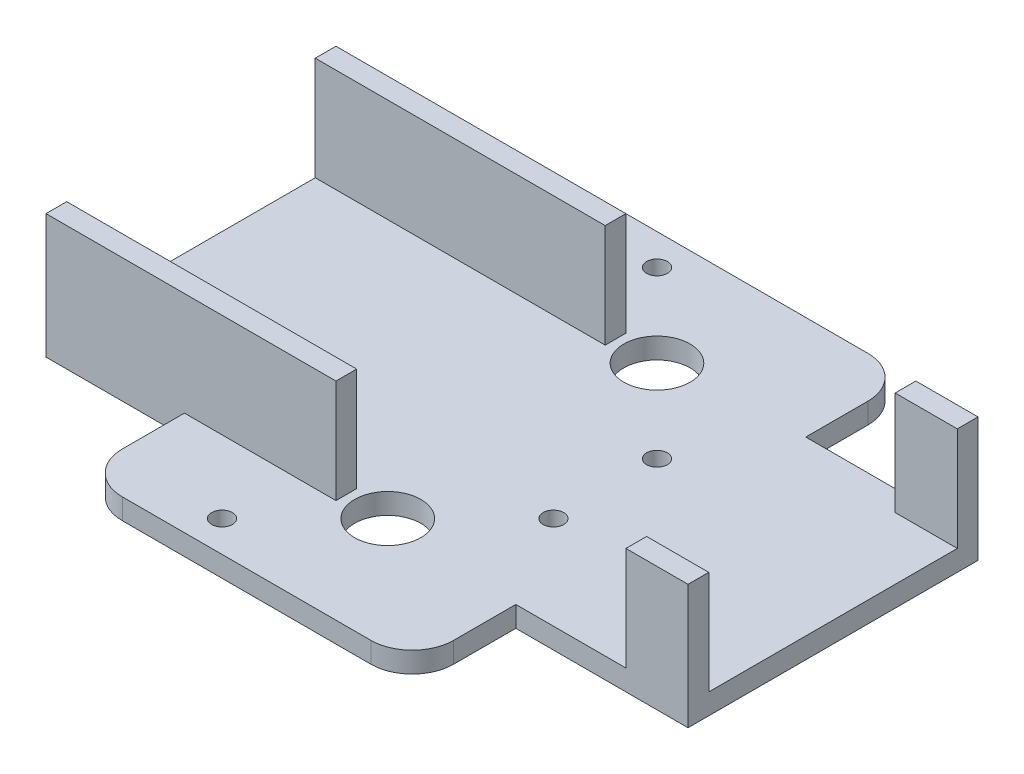
ISO-10303-21;
HEADER;
FILE_DESCRIPTION(('STEP AP214'),'2;1');
FILE_NAME('part.step','',(''),(''),'','','');
FILE_SCHEMA(('AUTOMOTIVE_DESIGN { 1 0 10303 214 1 1 1 1 }'));
ENDSEC;
DATA;
#1=APPLICATION_CONTEXT('core data for automotive mechanical design processes');
#2=APPLICATION_PROTOCOL_DEFINITION('international standard','automotive_design',2000,#1);
#3=PRODUCT_CONTEXT('',#1,'mechanical');
#4=PRODUCT('Part','Part','',(#3));
#5=PRODUCT_RELATED_PRODUCT_CATEGORY('part','',(#4));
#6=PRODUCT_DEFINITION_FORMATION('','',#4);
#7=PRODUCT_DEFINITION_CONTEXT('part definition',#1,'design');
#8=PRODUCT_DEFINITION('design','',#6,#7);
#9=PRODUCT_DEFINITION_SHAPE('','',#8);
#10=(LENGTH_UNIT() NAMED_UNIT(*) SI_UNIT(.MILLI.,.METRE.));
#11=(NAMED_UNIT(*) PLANE_ANGLE_UNIT() SI_UNIT($,.RADIAN.));
#12=(NAMED_UNIT(*) SI_UNIT($,.STERADIAN.) SOLID_ANGLE_UNIT());
#13=UNCERTAINTY_MEASURE_WITH_UNIT(LENGTH_MEASURE(1.E-05),#10,'distance_accuracy_value','');
#14=(GEOMETRIC_REPRESENTATION_CONTEXT(3) GLOBAL_UNCERTAINTY_ASSIGNED_CONTEXT((#13)) GLOBAL_UNIT_ASSIGNED_CONTEXT((#10,
#11,#12)) REPRESENTATION_CONTEXT('',''));
#15=CARTESIAN_POINT('',(0.,0.,0.));
#16=DIRECTION('',(0.,0.,1.));
#17=DIRECTION('',(1.,0.,0.));
#18=AXIS2_PLACEMENT_3D('',#15,#16,#17);
#19=CARTESIAN_POINT('',(-75.,30.,35.));
#20=DIRECTION('',(0.,0.,-1.));
#21=DIRECTION('',(-1.,0.,0.));
#22=AXIS2_PLACEMENT_3D('',#19,#20,#21);
#23=PLANE('',#22);
#24=DIRECTION('',(0.,-1.,0.));
#25=VECTOR('',#24,1.);
#26=CARTESIAN_POINT('',(-41.5789459333331,5.,35.));
#27=LINE('',#26,#25);
#28=CARTESIAN_POINT('',(-41.5789459333331,5.,35.));
#29=VERTEX_POINT('',#28);
#30=CARTESIAN_POINT('',(-41.5789459333331,0.,35.));
#31=VERTEX_POINT('',#30);
#32=EDGE_CURVE('E232',#29,#31,#27,.T.);
#33=ORIENTED_EDGE('',*,*,#32,.F.);
#34=DIRECTION('',(-1.,0.,0.));
#35=VECTOR('',#34,1.);
#36=CARTESIAN_POINT('',(-41.5789459333331,5.,35.));
#37=LINE('',#36,#35);
#38=CARTESIAN_POINT('',(-5.00000000000005,5.,35.));
#39=VERTEX_POINT('',#38);
#40=EDGE_CURVE('E315',#39,#29,#37,.T.);
#41=ORIENTED_EDGE('',*,*,#40,.F.);
#42=DIRECTION('',(0.,-1.,0.));
#43=VECTOR('',#42,1.);
#44=CARTESIAN_POINT('',(-5.00000000000005,30.,35.));
#45=LINE('',#44,#43);
#46=CARTESIAN_POINT('',(-5.00000000000005,30.,35.));
#47=VERTEX_POINT('',#46);
#48=EDGE_CURVE('E249',#47,#39,#45,.T.);
#49=ORIENTED_EDGE('',*,*,#48,.F.);
#50=DIRECTION('',(1.,0.,0.));
#51=VECTOR('',#50,1.);
#52=CARTESIAN_POINT('',(-75.,30.,35.));
#53=LINE('',#52,#51);
#54=CARTESIAN_POINT('',(-75.,30.,35.));
#55=VERTEX_POINT('',#54);
#56=EDGE_CURVE('E288',#55,#47,#53,.T.);
#57=ORIENTED_EDGE('',*,*,#56,.F.);
#58=DIRECTION('',(0.,-1.,0.));
#59=VECTOR('',#58,1.);
#60=CARTESIAN_POINT('',(-75.,30.,35.));
#61=LINE('',#60,#59);
#62=CARTESIAN_POINT('',(-75.,0.,35.));
#63=VERTEX_POINT('',#62);
#64=EDGE_CURVE('E306',#55,#63,#61,.T.);
#65=ORIENTED_EDGE('',*,*,#64,.T.);
#66=DIRECTION('',(1.,0.,0.));
#67=VECTOR('',#66,1.);
#68=CARTESIAN_POINT('',(-75.,0.,35.));
#69=LINE('',#68,#67);
#70=EDGE_CURVE('E301',#63,#31,#69,.T.);
#71=ORIENTED_EDGE('',*,*,#70,.T.);
#72=EDGE_LOOP('',(#33,#41,#49,#57,#65,#71));
#73=FACE_BOUND('',#72,.T.);
#74=ADVANCED_FACE('F35',(#73),#23,.F.);
#75=CARTESIAN_POINT('',(-75.,30.,-35.));
#76=DIRECTION('',(0.,0.,1.));
#77=DIRECTION('',(1.,0.,0.));
#78=AXIS2_PLACEMENT_3D('',#75,#76,#77);
#79=PLANE('',#78);
#80=DIRECTION('',(0.,-1.,0.));
#81=VECTOR('',#80,1.);
#82=CARTESIAN_POINT('',(38.4210540666668,5.,-35.));
#83=LINE('',#82,#81);
#84=CARTESIAN_POINT('',(38.4210540666668,5.,-35.));
#85=VERTEX_POINT('',#84);
#86=CARTESIAN_POINT('',(38.4210540666668,0.,-35.));
#87=VERTEX_POINT('',#86);
#88=EDGE_CURVE('E377',#85,#87,#83,.T.);
#89=ORIENTED_EDGE('',*,*,#88,.F.);
#90=DIRECTION('',(1.,0.,0.));
#91=VECTOR('',#90,1.);
#92=CARTESIAN_POINT('',(-5.00000000000004,5.,-35.));
#93=LINE('',#92,#91);
#94=CARTESIAN_POINT('',(65.,5.,-35.));
#95=VERTEX_POINT('',#94);
#96=EDGE_CURVE('E431',#85,#95,#93,.T.);
#97=ORIENTED_EDGE('',*,*,#96,.T.);
#98=DIRECTION('',(0.,1.,0.));
#99=VECTOR('',#98,1.);
#100=CARTESIAN_POINT('',(65.,30.,-35.));
#101=LINE('',#100,#99);
#102=CARTESIAN_POINT('',(65.,30.,-35.));
#103=VERTEX_POINT('',#102);
#104=EDGE_CURVE('E432',#95,#103,#101,.T.);
#105=ORIENTED_EDGE('',*,*,#104,.T.);
#106=DIRECTION('',(-1.,0.,0.));
#107=VECTOR('',#106,1.);
#108=CARTESIAN_POINT('',(-75.,30.,-35.));
#109=LINE('',#108,#107);
#110=CARTESIAN_POINT('',(80.,30.,-35.));
#111=VERTEX_POINT('',#110);
#112=EDGE_CURVE('E280',#111,#103,#109,.T.);
#113=ORIENTED_EDGE('',*,*,#112,.F.);
#114=DIRECTION('',(0.,-1.,0.));
#115=VECTOR('',#114,1.);
#116=CARTESIAN_POINT('',(80.,30.,-35.));
#117=LINE('',#116,#115);
#118=CARTESIAN_POINT('',(80.,0.,-35.));
#119=VERTEX_POINT('',#118);
#120=EDGE_CURVE('E312',#111,#119,#117,.T.);
#121=ORIENTED_EDGE('',*,*,#120,.T.);
#122=DIRECTION('',(-1.,0.,0.));
#123=VECTOR('',#122,1.);
#124=CARTESIAN_POINT('',(-75.,0.,-35.));
#125=LINE('',#124,#123);
#126=EDGE_CURVE('E295',#119,#87,#125,.T.);
#127=ORIENTED_EDGE('',*,*,#126,.T.);
#128=EDGE_LOOP('',(#89,#97,#105,#113,#121,#127));
#129=FACE_BOUND('',#128,.T.);
#130=ADVANCED_FACE('F526',(#129),#79,.F.);
#131=DIRECTION('',(1.,0.,0.));
#132=VECTOR('',#131,1.);
#133=CARTESIAN_POINT('',(-41.5789459333331,5.,-35.));
#134=LINE('',#133,#132);
#135=CARTESIAN_POINT('',(-41.5789459333331,5.,-35.));
#136=VERTEX_POINT('',#135);
#137=CARTESIAN_POINT('',(-5.00000000000005,5.,-35.));
#138=VERTEX_POINT('',#137);
#139=EDGE_CURVE('E370',#136,#138,#134,.T.);
#140=ORIENTED_EDGE('',*,*,#139,.F.);
#141=DIRECTION('',(0.,-1.,0.));
#142=VECTOR('',#141,1.);
#143=CARTESIAN_POINT('',(-41.5789459333331,5.,-35.));
#144=LINE('',#143,#142);
#145=CARTESIAN_POINT('',(-41.5789459333331,0.,-35.));
#146=VERTEX_POINT('',#145);
#147=EDGE_CURVE('E385',#136,#146,#144,.T.);
#148=ORIENTED_EDGE('',*,*,#147,.T.);
#149=CARTESIAN_POINT('',(-75.,0.,-35.));
#150=VERTEX_POINT('',#149);
#151=EDGE_CURVE('E294',#146,#150,#125,.T.);
#152=ORIENTED_EDGE('',*,*,#151,.T.);
#153=DIRECTION('',(0.,-1.,0.));
#154=VECTOR('',#153,1.);
#155=CARTESIAN_POINT('',(-75.,30.,-35.));
#156=LINE('',#155,#154);
#157=CARTESIAN_POINT('',(-75.,30.,-35.));
#158=VERTEX_POINT('',#157);
#159=EDGE_CURVE('E309',#158,#150,#156,.T.);
#160=ORIENTED_EDGE('',*,*,#159,.F.);
#161=CARTESIAN_POINT('',(-5.00000000000005,30.,-35.));
#162=VERTEX_POINT('',#161);
#163=EDGE_CURVE('E278',#162,#158,#109,.T.);
#164=ORIENTED_EDGE('',*,*,#163,.F.);
#165=DIRECTION('',(0.,-1.,0.));
#166=VECTOR('',#165,1.);
#167=CARTESIAN_POINT('',(-5.00000000000005,30.,-35.));
#168=LINE('',#167,#166);
#169=EDGE_CURVE('E251',#162,#138,#168,.T.);
#170=ORIENTED_EDGE('',*,*,#169,.T.);
#171=EDGE_LOOP('',(#140,#148,#152,#160,#164,#170));
#172=FACE_BOUND('',#171,.T.);
#173=ADVANCED_FACE('F531',(#172),#79,.F.);
#174=CARTESIAN_POINT('',(0.,30.,0.));
#175=DIRECTION('',(0.,1.,0.));
#176=DIRECTION('',(0.,0.,1.));
#177=AXIS2_PLACEMENT_3D('',#174,#175,#176);
#178=PLANE('',#177);
#179=DIRECTION('',(1.,0.,0.));
#180=VECTOR('',#179,1.);
#181=CARTESIAN_POINT('',(-75.,30.,30.));
#182=LINE('',#181,#180);
#183=CARTESIAN_POINT('',(-75.,30.,30.));
#184=VERTEX_POINT('',#183);
#185=CARTESIAN_POINT('',(-5.00000000000005,30.,30.));
#186=VERTEX_POINT('',#185);
#187=EDGE_CURVE('E406',#184,#186,#182,.T.);
#188=ORIENTED_EDGE('',*,*,#187,.F.);
#189=DIRECTION('',(0.,0.,1.));
#190=VECTOR('',#189,1.);
#191=CARTESIAN_POINT('',(-75.,30.,-35.));
#192=LINE('',#191,#190);
#193=EDGE_CURVE('E283',#184,#55,#192,.T.);
#194=ORIENTED_EDGE('',*,*,#193,.T.);
#195=ORIENTED_EDGE('',*,*,#56,.T.);
#196=DIRECTION('',(0.,0.,1.));
#197=VECTOR('',#196,1.);
#198=CARTESIAN_POINT('',(-5.00000000000005,30.,-35.));
#199=LINE('',#198,#197);
#200=EDGE_CURVE('E262',#186,#47,#199,.T.);
#201=ORIENTED_EDGE('',*,*,#200,.F.);
#202=EDGE_LOOP('',(#188,#194,#195,#201));
#203=FACE_BOUND('',#202,.T.);
#204=ADVANCED_FACE('F450',(#203),#178,.T.);
#205=CARTESIAN_POINT('',(64.9999999999999,30.,30.));
#206=VERTEX_POINT('',#205);
#207=CARTESIAN_POINT('',(80.,30.,30.));
#208=VERTEX_POINT('',#207);
#209=EDGE_CURVE('E409',#206,#208,#182,.T.);
#210=ORIENTED_EDGE('',*,*,#209,.F.);
#211=DIRECTION('',(0.,0.,1.));
#212=VECTOR('',#211,1.);
#213=CARTESIAN_POINT('',(65.,30.,-35.));
#214=LINE('',#213,#212);
#215=CARTESIAN_POINT('',(64.9999999999999,30.,35.));
#216=VERTEX_POINT('',#215);
#217=EDGE_CURVE('E266',#206,#216,#214,.T.);
#218=ORIENTED_EDGE('',*,*,#217,.T.);
#219=CARTESIAN_POINT('',(80.,30.,35.));
#220=VERTEX_POINT('',#219);
#221=EDGE_CURVE('E287',#216,#220,#53,.T.);
#222=ORIENTED_EDGE('',*,*,#221,.T.);
#223=DIRECTION('',(0.,0.,-1.));
#224=VECTOR('',#223,1.);
#225=CARTESIAN_POINT('',(80.,30.,-35.));
#226=LINE('',#225,#224);
#227=EDGE_CURVE('E275',#220,#208,#226,.T.);
#228=ORIENTED_EDGE('',*,*,#227,.T.);
#229=EDGE_LOOP('',(#210,#218,#222,#228));
#230=FACE_BOUND('',#229,.T.);
#231=ADVANCED_FACE('F785',(#230),#178,.T.);
#232=CARTESIAN_POINT('',(-5.00000000000005,30.,-35.));
#233=DIRECTION('',(-1.,0.,0.));
#234=DIRECTION('',(0.,-1.,0.));
#235=AXIS2_PLACEMENT_3D('',#232,#233,#234);
#236=PLANE('',#235);
#237=DIRECTION('',(0.,0.,1.));
#238=VECTOR('',#237,1.);
#239=CARTESIAN_POINT('',(-5.00000000000004,5.,-35.));
#240=LINE('',#239,#238);
#241=CARTESIAN_POINT('',(-5.00000000000004,5.,30.));
#242=VERTEX_POINT('',#241);
#243=EDGE_CURVE('E274',#242,#39,#240,.T.);
#244=ORIENTED_EDGE('',*,*,#243,.F.);
#245=DIRECTION('',(0.,1.,0.));
#246=VECTOR('',#245,1.);
#247=CARTESIAN_POINT('',(-5.00000000000005,30.,30.));
#248=LINE('',#247,#246);
#249=EDGE_CURVE('E254',#242,#186,#248,.T.);
#250=ORIENTED_EDGE('',*,*,#249,.T.);
#251=ORIENTED_EDGE('',*,*,#200,.T.);
#252=ORIENTED_EDGE('',*,*,#48,.T.);
#253=EDGE_LOOP('',(#244,#250,#251,#252));
#254=FACE_BOUND('',#253,.T.);
#255=ADVANCED_FACE('F443',(#254),#236,.F.);
#256=CARTESIAN_POINT('',(65.,30.,-35.));
#257=DIRECTION('',(1.,0.,0.));
#258=DIRECTION('',(0.,0.,-1.));
#259=AXIS2_PLACEMENT_3D('',#256,#257,#258);
#260=PLANE('',#259);
#261=ORIENTED_EDGE('',*,*,#217,.F.);
#262=DIRECTION('',(0.,-1.,0.));
#263=VECTOR('',#262,1.);
#264=CARTESIAN_POINT('',(65.,30.,30.));
#265=LINE('',#264,#263);
#266=CARTESIAN_POINT('',(64.9999999999999,5.,30.));
#267=VERTEX_POINT('',#266);
#268=EDGE_CURVE('E424',#206,#267,#265,.T.);
#269=ORIENTED_EDGE('',*,*,#268,.T.);
#270=DIRECTION('',(0.,0.,1.));
#271=VECTOR('',#270,1.);
#272=CARTESIAN_POINT('',(65.,5.,-35.));
#273=LINE('',#272,#271);
#274=CARTESIAN_POINT('',(65.,5.,35.));
#275=VERTEX_POINT('',#274);
#276=EDGE_CURVE('E270',#267,#275,#273,.T.);
#277=ORIENTED_EDGE('',*,*,#276,.T.);
#278=DIRECTION('',(0.,1.,0.));
#279=VECTOR('',#278,1.);
#280=CARTESIAN_POINT('',(65.,30.,35.));
#281=LINE('',#280,#279);
#282=EDGE_CURVE('E248',#275,#216,#281,.T.);
#283=ORIENTED_EDGE('',*,*,#282,.T.);
#284=EDGE_LOOP('',(#261,#269,#277,#283));
#285=FACE_BOUND('',#284,.T.);
#286=ADVANCED_FACE('F599',(#285),#260,.F.);
#287=DIRECTION('',(1.,0.,0.));
#288=VECTOR('',#287,1.);
#289=CARTESIAN_POINT('',(-75.,30.,-30.));
#290=LINE('',#289,#288);
#291=CARTESIAN_POINT('',(-75.,30.,-30.));
#292=VERTEX_POINT('',#291);
#293=CARTESIAN_POINT('',(-5.00000000000005,30.,-30.));
#294=VERTEX_POINT('',#293);
#295=EDGE_CURVE('E410',#292,#294,#290,.T.);
#296=ORIENTED_EDGE('',*,*,#295,.T.);
#297=EDGE_CURVE('E258',#162,#294,#199,.T.);
#298=ORIENTED_EDGE('',*,*,#297,.F.);
#299=ORIENTED_EDGE('',*,*,#163,.T.);
#300=EDGE_CURVE('E284',#158,#292,#192,.T.);
#301=ORIENTED_EDGE('',*,*,#300,.T.);
#302=EDGE_LOOP('',(#296,#298,#299,#301));
#303=FACE_BOUND('',#302,.T.);
#304=ADVANCED_FACE('F543',(#303),#178,.T.);
#305=CARTESIAN_POINT('',(80.,30.,-35.));
#306=DIRECTION('',(-1.,0.,0.));
#307=DIRECTION('',(0.,0.,1.));
#308=AXIS2_PLACEMENT_3D('',#305,#306,#307);
#309=PLANE('',#308);
#310=DIRECTION('',(0.,0.,-1.));
#311=VECTOR('',#310,1.);
#312=CARTESIAN_POINT('',(80.,5.,30.));
#313=LINE('',#312,#311);
#314=CARTESIAN_POINT('',(80.,5.,30.));
#315=VERTEX_POINT('',#314);
#316=CARTESIAN_POINT('',(80.,5.,-30.));
#317=VERTEX_POINT('',#316);
#318=EDGE_CURVE('E402',#315,#317,#313,.T.);
#319=ORIENTED_EDGE('',*,*,#318,.F.);
#320=DIRECTION('',(0.,-1.,0.));
#321=VECTOR('',#320,1.);
#322=CARTESIAN_POINT('',(80.,30.,30.));
#323=LINE('',#322,#321);
#324=EDGE_CURVE('E388',#208,#315,#323,.T.);
#325=ORIENTED_EDGE('',*,*,#324,.F.);
#326=ORIENTED_EDGE('',*,*,#227,.F.);
#327=DIRECTION('',(0.,-1.,0.));
#328=VECTOR('',#327,1.);
#329=CARTESIAN_POINT('',(80.,30.,35.));
#330=LINE('',#329,#328);
#331=CARTESIAN_POINT('',(80.,0.,35.));
#332=VERTEX_POINT('',#331);
#333=EDGE_CURVE('E291',#220,#332,#330,.T.);
#334=ORIENTED_EDGE('',*,*,#333,.T.);
#335=DIRECTION('',(0.,0.,-1.));
#336=VECTOR('',#335,1.);
#337=CARTESIAN_POINT('',(80.,0.,-35.));
#338=LINE('',#337,#336);
#339=EDGE_CURVE('E261',#332,#119,#338,.T.);
#340=ORIENTED_EDGE('',*,*,#339,.T.);
#341=ORIENTED_EDGE('',*,*,#120,.F.);
#342=CARTESIAN_POINT('',(80.,30.,-30.));
#343=VERTEX_POINT('',#342);
#344=EDGE_CURVE('E279',#343,#111,#226,.T.);
#345=ORIENTED_EDGE('',*,*,#344,.F.);
#346=DIRECTION('',(0.,1.,0.));
#347=VECTOR('',#346,1.);
#348=CARTESIAN_POINT('',(80.,30.,-30.));
#349=LINE('',#348,#347);
#350=EDGE_CURVE('E393',#317,#343,#349,.T.);
#351=ORIENTED_EDGE('',*,*,#350,.F.);
#352=EDGE_LOOP('',(#319,#325,#326,#334,#340,#341,#345,#351));
#353=FACE_BOUND('',#352,.T.);
#354=ADVANCED_FACE('F544',(#353),#309,.F.);
#355=CARTESIAN_POINT('',(-75.,30.,-35.));
#356=DIRECTION('',(1.,0.,0.));
#357=DIRECTION('',(0.,0.,-1.));
#358=AXIS2_PLACEMENT_3D('',#355,#356,#357);
#359=PLANE('',#358);
#360=ORIENTED_EDGE('',*,*,#193,.F.);
#361=DIRECTION('',(0.,-1.,0.));
#362=VECTOR('',#361,1.);
#363=CARTESIAN_POINT('',(-75.,30.,30.));
#364=LINE('',#363,#362);
#365=CARTESIAN_POINT('',(-75.,5.,30.));
#366=VERTEX_POINT('',#365);
#367=EDGE_CURVE('E389',#184,#366,#364,.T.);
#368=ORIENTED_EDGE('',*,*,#367,.T.);
#369=DIRECTION('',(0.,0.,-1.));
#370=VECTOR('',#369,1.);
#371=CARTESIAN_POINT('',(-75.,5.,30.));
#372=LINE('',#371,#370);
#373=CARTESIAN_POINT('',(-75.,5.,-30.));
#374=VERTEX_POINT('',#373);
#375=EDGE_CURVE('E392',#366,#374,#372,.T.);
#376=ORIENTED_EDGE('',*,*,#375,.T.);
#377=DIRECTION('',(0.,1.,0.));
#378=VECTOR('',#377,1.);
#379=CARTESIAN_POINT('',(-75.,30.,-30.));
#380=LINE('',#379,#378);
#381=EDGE_CURVE('E396',#374,#292,#380,.T.);
#382=ORIENTED_EDGE('',*,*,#381,.T.);
#383=ORIENTED_EDGE('',*,*,#300,.F.);
#384=ORIENTED_EDGE('',*,*,#159,.T.);
#385=DIRECTION('',(0.,0.,1.));
#386=VECTOR('',#385,1.);
#387=CARTESIAN_POINT('',(-75.,0.,-35.));
#388=LINE('',#387,#386);
#389=EDGE_CURVE('E298',#150,#63,#388,.T.);
#390=ORIENTED_EDGE('',*,*,#389,.T.);
#391=ORIENTED_EDGE('',*,*,#64,.F.);
#392=EDGE_LOOP('',(#360,#368,#376,#382,#383,#384,#390,#391));
#393=FACE_BOUND('',#392,.T.);
#394=ADVANCED_FACE('F454',(#393),#359,.F.);
#395=DIRECTION('',(1.,0.,0.));
#396=VECTOR('',#395,1.);
#397=CARTESIAN_POINT('',(-5.00000000000004,5.,35.));
#398=LINE('',#397,#396);
#399=CARTESIAN_POINT('',(38.4210540666669,5.,35.));
#400=VERTEX_POINT('',#399);
#401=EDGE_CURVE('E225',#400,#275,#398,.T.);
#402=ORIENTED_EDGE('',*,*,#401,.F.);
#403=DIRECTION('',(0.,-1.,0.));
#404=VECTOR('',#403,1.);
#405=CARTESIAN_POINT('',(38.4210540666669,5.,35.));
#406=LINE('',#405,#404);
#407=CARTESIAN_POINT('',(38.4210540666669,0.,35.));
#408=VERTEX_POINT('',#407);
#409=EDGE_CURVE('E236',#400,#408,#406,.T.);
#410=ORIENTED_EDGE('',*,*,#409,.T.);
#411=EDGE_CURVE('E300',#408,#332,#69,.T.);
#412=ORIENTED_EDGE('',*,*,#411,.T.);
#413=ORIENTED_EDGE('',*,*,#333,.F.);
#414=ORIENTED_EDGE('',*,*,#221,.F.);
#415=ORIENTED_EDGE('',*,*,#282,.F.);
#416=EDGE_LOOP('',(#402,#410,#412,#413,#414,#415));
#417=FACE_BOUND('',#416,.T.);
#418=ADVANCED_FACE('F245',(#417),#23,.F.);
#419=CARTESIAN_POINT('',(64.9999999999999,30.,-30.));
#420=VERTEX_POINT('',#419);
#421=EDGE_CURVE('E413',#420,#343,#290,.T.);
#422=ORIENTED_EDGE('',*,*,#421,.T.);
#423=ORIENTED_EDGE('',*,*,#344,.T.);
#424=ORIENTED_EDGE('',*,*,#112,.T.);
#425=EDGE_CURVE('E263',#103,#420,#214,.T.);
#426=ORIENTED_EDGE('',*,*,#425,.T.);
#427=EDGE_LOOP('',(#422,#423,#424,#426));
#428=FACE_BOUND('',#427,.T.);
#429=ADVANCED_FACE('F536',(#428),#178,.T.);
#430=CARTESIAN_POINT('',(0.,0.,0.));
#431=DIRECTION('',(0.,1.,0.));
#432=DIRECTION('',(0.,0.,1.));
#433=AXIS2_PLACEMENT_3D('',#430,#431,#432);
#434=PLANE('',#433);
#435=CARTESIAN_POINT('',(-15.,0.,52.5));
#436=DIRECTION('',(0.,1.,0.));
#437=DIRECTION('',(0.,0.,1.));
#438=AXIS2_PLACEMENT_3D('',#435,#436,#437);
#439=CIRCLE('',#438,2.5);
#440=CARTESIAN_POINT('',(-15.,0.,55.));
#441=VERTEX_POINT('',#440);
#442=EDGE_CURVE('E483',#441,#441,#439,.T.);
#443=ORIENTED_EDGE('',*,*,#442,.T.);
#444=EDGE_LOOP('',(#443));
#445=FACE_BOUND('',#444,.T.);
#446=CARTESIAN_POINT('',(25.,0.,-12.5));
#447=DIRECTION('',(0.,1.,0.));
#448=DIRECTION('',(0.,0.,1.));
#449=AXIS2_PLACEMENT_3D('',#446,#447,#448);
#450=CIRCLE('',#449,2.49999999999999);
#451=CARTESIAN_POINT('',(25.,0.,-10.));
#452=VERTEX_POINT('',#451);
#453=EDGE_CURVE('E472',#452,#452,#450,.T.);
#454=ORIENTED_EDGE('',*,*,#453,.T.);
#455=EDGE_LOOP('',(#454));
#456=FACE_BOUND('',#455,.T.);
#457=CARTESIAN_POINT('',(-15.,0.,-52.5));
#458=DIRECTION('',(0.,1.,0.));
#459=DIRECTION('',(0.,0.,1.));
#460=AXIS2_PLACEMENT_3D('',#457,#458,#459);
#461=CIRCLE('',#460,2.5);
#462=CARTESIAN_POINT('',(-15.,0.,-50.));
#463=VERTEX_POINT('',#462);
#464=EDGE_CURVE('E471',#463,#463,#461,.T.);
#465=ORIENTED_EDGE('',*,*,#464,.T.);
#466=EDGE_LOOP('',(#465));
#467=FACE_BOUND('',#466,.T.);
#468=CARTESIAN_POINT('',(4.99999999999997,0.,32.5));
#469=DIRECTION('',(0.,1.,0.));
#470=DIRECTION('',(0.,0.,1.));
#471=AXIS2_PLACEMENT_3D('',#468,#469,#470);
#472=CIRCLE('',#471,8.);
#473=CARTESIAN_POINT('',(4.99999999999997,0.,40.5));
#474=VERTEX_POINT('',#473);
#475=EDGE_CURVE('E465',#474,#474,#472,.T.);
#476=ORIENTED_EDGE('',*,*,#475,.T.);
#477=EDGE_LOOP('',(#476));
#478=FACE_BOUND('',#477,.T.);
#479=CARTESIAN_POINT('',(25.,0.,12.5));
#480=DIRECTION('',(0.,1.,0.));
#481=DIRECTION('',(0.,0.,1.));
#482=AXIS2_PLACEMENT_3D('',#479,#480,#481);
#483=CIRCLE('',#482,2.5);
#484=CARTESIAN_POINT('',(25.,0.,15.));
#485=VERTEX_POINT('',#484);
#486=EDGE_CURVE('E484',#485,#485,#483,.T.);
#487=ORIENTED_EDGE('',*,*,#486,.T.);
#488=EDGE_LOOP('',(#487));
#489=FACE_BOUND('',#488,.T.);
#490=CARTESIAN_POINT('',(4.99999999999996,0.,-32.5));
#491=DIRECTION('',(0.,1.,0.));
#492=DIRECTION('',(0.,0.,1.));
#493=AXIS2_PLACEMENT_3D('',#490,#491,#492);
#494=CIRCLE('',#493,8.);
#495=CARTESIAN_POINT('',(4.99999999999996,0.,-24.5));
#496=VERTEX_POINT('',#495);
#497=EDGE_CURVE('E363',#496,#496,#494,.T.);
#498=ORIENTED_EDGE('',*,*,#497,.T.);
#499=EDGE_LOOP('',(#498));
#500=FACE_BOUND('',#499,.T.);
#501=DIRECTION('',(-1.,0.,0.));
#502=VECTOR('',#501,1.);
#503=CARTESIAN_POINT('',(-41.5789459333331,0.,-60.));
#504=LINE('',#503,#502);
#505=CARTESIAN_POINT('',(28.4210540666669,0.,-60.));
#506=VERTEX_POINT('',#505);
#507=CARTESIAN_POINT('',(-31.5789459333331,0.,-60.));
#508=VERTEX_POINT('',#507);
#509=EDGE_CURVE('E371',#506,#508,#504,.T.);
#510=ORIENTED_EDGE('',*,*,#509,.F.);
#511=CARTESIAN_POINT('',(28.4210540666669,0.,-50.));
#512=DIRECTION('',(0.,1.,0.));
#513=DIRECTION('',(0.,0.,1.));
#514=AXIS2_PLACEMENT_3D('',#511,#512,#513);
#515=CIRCLE('',#514,10.);
#516=CARTESIAN_POINT('',(38.4210540666669,0.,-50.));
#517=VERTEX_POINT('',#516);
#518=EDGE_CURVE('E334',#506,#517,#515,.F.);
#519=ORIENTED_EDGE('',*,*,#518,.T.);
#520=DIRECTION('',(0.,0.,-1.));
#521=VECTOR('',#520,1.);
#522=CARTESIAN_POINT('',(38.4210540666669,0.,-60.));
#523=LINE('',#522,#521);
#524=EDGE_CURVE('E379',#87,#517,#523,.T.);
#525=ORIENTED_EDGE('',*,*,#524,.F.);
#526=ORIENTED_EDGE('',*,*,#126,.F.);
#527=ORIENTED_EDGE('',*,*,#339,.F.);
#528=ORIENTED_EDGE('',*,*,#411,.F.);
#529=DIRECTION('',(0.,0.,-1.));
#530=VECTOR('',#529,1.);
#531=CARTESIAN_POINT('',(38.4210540666669,0.,35.));
#532=LINE('',#531,#530);
#533=CARTESIAN_POINT('',(38.4210540666669,0.,50.));
#534=VERTEX_POINT('',#533);
#535=EDGE_CURVE('E239',#534,#408,#532,.T.);
#536=ORIENTED_EDGE('',*,*,#535,.F.);
#537=CARTESIAN_POINT('',(28.4210540666669,0.,50.));
#538=DIRECTION('',(0.,1.,0.));
#539=DIRECTION('',(0.,0.,1.));
#540=AXIS2_PLACEMENT_3D('',#537,#538,#539);
#541=CIRCLE('',#540,10.);
#542=CARTESIAN_POINT('',(28.4210540666669,0.,60.));
#543=VERTEX_POINT('',#542);
#544=EDGE_CURVE('E318',#534,#543,#541,.F.);
#545=ORIENTED_EDGE('',*,*,#544,.T.);
#546=DIRECTION('',(1.,0.,0.));
#547=VECTOR('',#546,1.);
#548=CARTESIAN_POINT('',(-41.5789459333331,0.,60.));
#549=LINE('',#548,#547);
#550=CARTESIAN_POINT('',(-31.5789459333331,0.,60.));
#551=VERTEX_POINT('',#550);
#552=EDGE_CURVE('E351',#551,#543,#549,.T.);
#553=ORIENTED_EDGE('',*,*,#552,.F.);
#554=CARTESIAN_POINT('',(-31.5789459333331,0.,50.));
#555=DIRECTION('',(0.,1.,0.));
#556=DIRECTION('',(0.,0.,1.));
#557=AXIS2_PLACEMENT_3D('',#554,#555,#556);
#558=CIRCLE('',#557,10.);
#559=CARTESIAN_POINT('',(-41.5789459333331,0.,50.));
#560=VERTEX_POINT('',#559);
#561=EDGE_CURVE('E330',#551,#560,#558,.F.);
#562=ORIENTED_EDGE('',*,*,#561,.T.);
#563=DIRECTION('',(0.,0.,1.));
#564=VECTOR('',#563,1.);
#565=CARTESIAN_POINT('',(-41.5789459333331,0.,35.));
#566=LINE('',#565,#564);
#567=EDGE_CURVE('E359',#31,#560,#566,.T.);
#568=ORIENTED_EDGE('',*,*,#567,.F.);
#569=ORIENTED_EDGE('',*,*,#70,.F.);
#570=ORIENTED_EDGE('',*,*,#389,.F.);
#571=ORIENTED_EDGE('',*,*,#151,.F.);
#572=DIRECTION('',(0.,0.,1.));
#573=VECTOR('',#572,1.);
#574=CARTESIAN_POINT('',(-41.5789459333331,0.,-60.));
#575=LINE('',#574,#573);
#576=CARTESIAN_POINT('',(-41.5789459333331,0.,-50.));
#577=VERTEX_POINT('',#576);
#578=EDGE_CURVE('E242',#577,#146,#575,.T.);
#579=ORIENTED_EDGE('',*,*,#578,.F.);
#580=CARTESIAN_POINT('',(-31.5789459333331,0.,-50.));
#581=DIRECTION('',(0.,1.,0.));
#582=DIRECTION('',(0.,0.,1.));
#583=AXIS2_PLACEMENT_3D('',#580,#581,#582);
#584=CIRCLE('',#583,10.);
#585=EDGE_CURVE('E332',#577,#508,#584,.F.);
#586=ORIENTED_EDGE('',*,*,#585,.T.);
#587=EDGE_LOOP('',(#510,#519,#525,#526,#527,#528,#536,#545,#553,#562,#568,#569,#570,#571,#579,#586));
#588=FACE_BOUND('',#587,.T.);
#589=ADVANCED_FACE('F356',(#445,#456,#467,#478,#489,#500,#588),#434,.F.);
#590=ORIENTED_EDGE('',*,*,#297,.T.);
#591=DIRECTION('',(0.,-1.,0.));
#592=VECTOR('',#591,1.);
#593=CARTESIAN_POINT('',(-5.00000000000005,30.,-30.));
#594=LINE('',#593,#592);
#595=CARTESIAN_POINT('',(-5.00000000000005,5.,-30.));
#596=VERTEX_POINT('',#595);
#597=EDGE_CURVE('E421',#294,#596,#594,.T.);
#598=ORIENTED_EDGE('',*,*,#597,.T.);
#599=EDGE_CURVE('E271',#138,#596,#240,.T.);
#600=ORIENTED_EDGE('',*,*,#599,.F.);
#601=ORIENTED_EDGE('',*,*,#169,.F.);
#602=EDGE_LOOP('',(#590,#598,#600,#601));
#603=FACE_BOUND('',#602,.T.);
#604=ADVANCED_FACE('F581',(#603),#236,.F.);
#605=CARTESIAN_POINT('',(65.,5.,-30.));
#606=VERTEX_POINT('',#605);
#607=EDGE_CURVE('E267',#95,#606,#273,.T.);
#608=ORIENTED_EDGE('',*,*,#607,.T.);
#609=DIRECTION('',(0.,1.,0.));
#610=VECTOR('',#609,1.);
#611=CARTESIAN_POINT('',(65.,30.,-30.));
#612=LINE('',#611,#610);
#613=EDGE_CURVE('E408',#606,#420,#612,.T.);
#614=ORIENTED_EDGE('',*,*,#613,.T.);
#615=ORIENTED_EDGE('',*,*,#425,.F.);
#616=ORIENTED_EDGE('',*,*,#104,.F.);
#617=EDGE_LOOP('',(#608,#614,#615,#616));
#618=FACE_BOUND('',#617,.T.);
#619=ADVANCED_FACE('F511',(#618),#260,.F.);
#620=CARTESIAN_POINT('',(-5.00000000000004,5.,-35.));
#621=DIRECTION('',(0.,-1.,0.));
#622=DIRECTION('',(0.,0.,-1.));
#623=AXIS2_PLACEMENT_3D('',#620,#621,#622);
#624=PLANE('',#623);
#625=CARTESIAN_POINT('',(-15.,5.,52.5));
#626=DIRECTION('',(0.,1.,0.));
#627=DIRECTION('',(0.,0.,1.));
#628=AXIS2_PLACEMENT_3D('',#625,#626,#627);
#629=CIRCLE('',#628,2.5);
#630=CARTESIAN_POINT('',(-15.,5.,55.));
#631=VERTEX_POINT('',#630);
#632=EDGE_CURVE('E480',#631,#631,#629,.T.);
#633=ORIENTED_EDGE('',*,*,#632,.F.);
#634=EDGE_LOOP('',(#633));
#635=FACE_BOUND('',#634,.T.);
#636=CARTESIAN_POINT('',(25.,5.,-12.5));
#637=DIRECTION('',(0.,1.,0.));
#638=DIRECTION('',(0.,0.,1.));
#639=AXIS2_PLACEMENT_3D('',#636,#637,#638);
#640=CIRCLE('',#639,2.49999999999999);
#641=CARTESIAN_POINT('',(25.,5.,-10.));
#642=VERTEX_POINT('',#641);
#643=EDGE_CURVE('E487',#642,#642,#640,.T.);
#644=ORIENTED_EDGE('',*,*,#643,.F.);
#645=EDGE_LOOP('',(#644));
#646=FACE_BOUND('',#645,.T.);
#647=CARTESIAN_POINT('',(-15.,5.,-52.5));
#648=DIRECTION('',(0.,1.,0.));
#649=DIRECTION('',(0.,0.,1.));
#650=AXIS2_PLACEMENT_3D('',#647,#648,#649);
#651=CIRCLE('',#650,2.5);
#652=CARTESIAN_POINT('',(-15.,5.,-50.));
#653=VERTEX_POINT('',#652);
#654=EDGE_CURVE('E468',#653,#653,#651,.T.);
#655=ORIENTED_EDGE('',*,*,#654,.F.);
#656=EDGE_LOOP('',(#655));
#657=FACE_BOUND('',#656,.T.);
#658=CARTESIAN_POINT('',(4.99999999999997,5.,32.5));
#659=DIRECTION('',(0.,1.,0.));
#660=DIRECTION('',(0.,0.,1.));
#661=AXIS2_PLACEMENT_3D('',#658,#659,#660);
#662=CIRCLE('',#661,8.);
#663=CARTESIAN_POINT('',(4.99999999999997,5.,40.5));
#664=VERTEX_POINT('',#663);
#665=EDGE_CURVE('E475',#664,#664,#662,.T.);
#666=ORIENTED_EDGE('',*,*,#665,.F.);
#667=EDGE_LOOP('',(#666));
#668=FACE_BOUND('',#667,.T.);
#669=CARTESIAN_POINT('',(25.,5.,12.5));
#670=DIRECTION('',(0.,1.,0.));
#671=DIRECTION('',(0.,0.,1.));
#672=AXIS2_PLACEMENT_3D('',#669,#670,#671);
#673=CIRCLE('',#672,2.5);
#674=CARTESIAN_POINT('',(25.,5.,15.));
#675=VERTEX_POINT('',#674);
#676=EDGE_CURVE('E492',#675,#675,#673,.T.);
#677=ORIENTED_EDGE('',*,*,#676,.F.);
#678=EDGE_LOOP('',(#677));
#679=FACE_BOUND('',#678,.T.);
#680=CARTESIAN_POINT('',(4.99999999999996,5.,-32.5));
#681=DIRECTION('',(0.,1.,0.));
#682=DIRECTION('',(0.,0.,1.));
#683=AXIS2_PLACEMENT_3D('',#680,#681,#682);
#684=CIRCLE('',#683,8.);
#685=CARTESIAN_POINT('',(4.99999999999996,5.,-24.5));
#686=VERTEX_POINT('',#685);
#687=EDGE_CURVE('E462',#686,#686,#684,.T.);
#688=ORIENTED_EDGE('',*,*,#687,.F.);
#689=EDGE_LOOP('',(#688));
#690=FACE_BOUND('',#689,.T.);
#691=DIRECTION('',(0.,0.,-1.));
#692=VECTOR('',#691,1.);
#693=CARTESIAN_POINT('',(38.4210540666669,5.,-60.));
#694=LINE('',#693,#692);
#695=CARTESIAN_POINT('',(38.4210540666669,5.,-50.));
#696=VERTEX_POINT('',#695);
#697=EDGE_CURVE('E373',#85,#696,#694,.T.);
#698=ORIENTED_EDGE('',*,*,#697,.T.);
#699=CARTESIAN_POINT('',(28.4210540666669,5.,-50.));
#700=DIRECTION('',(0.,-1.,0.));
#701=DIRECTION('',(0.,0.,-1.));
#702=AXIS2_PLACEMENT_3D('',#699,#700,#701);
#703=CIRCLE('',#702,10.);
#704=CARTESIAN_POINT('',(28.4210540666669,5.,-60.));
#705=VERTEX_POINT('',#704);
#706=EDGE_CURVE('E341',#696,#705,#703,.F.);
#707=ORIENTED_EDGE('',*,*,#706,.T.);
#708=DIRECTION('',(-1.,0.,0.));
#709=VECTOR('',#708,1.);
#710=CARTESIAN_POINT('',(-41.5789459333331,5.,-60.));
#711=LINE('',#710,#709);
#712=CARTESIAN_POINT('',(-31.5789459333331,5.,-60.));
#713=VERTEX_POINT('',#712);
#714=EDGE_CURVE('E375',#705,#713,#711,.T.);
#715=ORIENTED_EDGE('',*,*,#714,.T.);
#716=CARTESIAN_POINT('',(-31.5789459333331,5.,-50.));
#717=DIRECTION('',(0.,-1.,0.));
#718=DIRECTION('',(0.,0.,-1.));
#719=AXIS2_PLACEMENT_3D('',#716,#717,#718);
#720=CIRCLE('',#719,10.);
#721=CARTESIAN_POINT('',(-41.5789459333331,5.,-50.));
#722=VERTEX_POINT('',#721);
#723=EDGE_CURVE('E56',#713,#722,#720,.F.);
#724=ORIENTED_EDGE('',*,*,#723,.T.);
#725=DIRECTION('',(0.,0.,1.));
#726=VECTOR('',#725,1.);
#727=CARTESIAN_POINT('',(-41.5789459333331,5.,-60.));
#728=LINE('',#727,#726);
#729=EDGE_CURVE('E368',#722,#136,#728,.T.);
#730=ORIENTED_EDGE('',*,*,#729,.T.);
#731=ORIENTED_EDGE('',*,*,#139,.T.);
#732=ORIENTED_EDGE('',*,*,#599,.T.);
#733=DIRECTION('',(1.,0.,0.));
#734=VECTOR('',#733,1.);
#735=CARTESIAN_POINT('',(-75.,5.,-30.));
#736=LINE('',#735,#734);
#737=EDGE_CURVE('E414',#374,#596,#736,.T.);
#738=ORIENTED_EDGE('',*,*,#737,.F.);
#739=ORIENTED_EDGE('',*,*,#375,.F.);
#740=DIRECTION('',(1.,0.,0.));
#741=VECTOR('',#740,1.);
#742=CARTESIAN_POINT('',(-75.,5.,30.));
#743=LINE('',#742,#741);
#744=EDGE_CURVE('E417',#366,#242,#743,.T.);
#745=ORIENTED_EDGE('',*,*,#744,.T.);
#746=ORIENTED_EDGE('',*,*,#243,.T.);
#747=ORIENTED_EDGE('',*,*,#40,.T.);
#748=DIRECTION('',(0.,0.,1.));
#749=VECTOR('',#748,1.);
#750=CARTESIAN_POINT('',(-41.5789459333331,5.,35.));
#751=LINE('',#750,#749);
#752=CARTESIAN_POINT('',(-41.5789459333331,5.,50.));
#753=VERTEX_POINT('',#752);
#754=EDGE_CURVE('E361',#29,#753,#751,.T.);
#755=ORIENTED_EDGE('',*,*,#754,.T.);
#756=CARTESIAN_POINT('',(-31.5789459333331,5.,50.));
#757=DIRECTION('',(0.,-1.,0.));
#758=DIRECTION('',(0.,0.,-1.));
#759=AXIS2_PLACEMENT_3D('',#756,#757,#758);
#760=CIRCLE('',#759,10.);
#761=CARTESIAN_POINT('',(-31.5789459333331,5.,60.));
#762=VERTEX_POINT('',#761);
#763=EDGE_CURVE('E338',#753,#762,#760,.F.);
#764=ORIENTED_EDGE('',*,*,#763,.T.);
#765=DIRECTION('',(1.,0.,0.));
#766=VECTOR('',#765,1.);
#767=CARTESIAN_POINT('',(-41.5789459333331,5.,60.));
#768=LINE('',#767,#766);
#769=CARTESIAN_POINT('',(28.4210540666669,5.,60.));
#770=VERTEX_POINT('',#769);
#771=EDGE_CURVE('E233',#762,#770,#768,.T.);
#772=ORIENTED_EDGE('',*,*,#771,.T.);
#773=CARTESIAN_POINT('',(28.4210540666669,5.,50.));
#774=DIRECTION('',(0.,-1.,0.));
#775=DIRECTION('',(0.,0.,-1.));
#776=AXIS2_PLACEMENT_3D('',#773,#774,#775);
#777=CIRCLE('',#776,10.);
#778=CARTESIAN_POINT('',(38.4210540666669,5.,50.));
#779=VERTEX_POINT('',#778);
#780=EDGE_CURVE('E228',#770,#779,#777,.F.);
#781=ORIENTED_EDGE('',*,*,#780,.T.);
#782=DIRECTION('',(0.,0.,-1.));
#783=VECTOR('',#782,1.);
#784=CARTESIAN_POINT('',(38.4210540666669,5.,35.));
#785=LINE('',#784,#783);
#786=EDGE_CURVE('E219',#779,#400,#785,.T.);
#787=ORIENTED_EDGE('',*,*,#786,.T.);
#788=ORIENTED_EDGE('',*,*,#401,.T.);
#789=ORIENTED_EDGE('',*,*,#276,.F.);
#790=EDGE_CURVE('E399',#267,#315,#743,.T.);
#791=ORIENTED_EDGE('',*,*,#790,.T.);
#792=ORIENTED_EDGE('',*,*,#318,.T.);
#793=EDGE_CURVE('E416',#606,#317,#736,.T.);
#794=ORIENTED_EDGE('',*,*,#793,.F.);
#795=ORIENTED_EDGE('',*,*,#607,.F.);
#796=ORIENTED_EDGE('',*,*,#96,.F.);
#797=EDGE_LOOP('',(#698,#707,#715,#724,#730,#731,#732,#738,#739,#745,#746,#747,#755,#764,#772,
#781,#787,#788,#789,#791,#792,#794,#795,#796));
#798=FACE_BOUND('',#797,.T.);
#799=ADVANCED_FACE('F222',(#635,#646,#657,#668,#679,#690,#798),#624,.F.);
#800=CARTESIAN_POINT('',(-75.,30.,-30.));
#801=DIRECTION('',(0.,0.,-1.));
#802=DIRECTION('',(-1.,0.,0.));
#803=AXIS2_PLACEMENT_3D('',#800,#801,#802);
#804=PLANE('',#803);
#805=ORIENTED_EDGE('',*,*,#793,.T.);
#806=ORIENTED_EDGE('',*,*,#350,.T.);
#807=ORIENTED_EDGE('',*,*,#421,.F.);
#808=ORIENTED_EDGE('',*,*,#613,.F.);
#809=EDGE_LOOP('',(#805,#806,#807,#808));
#810=FACE_BOUND('',#809,.T.);
#811=ADVANCED_FACE('F510',(#810),#804,.F.);
#812=CARTESIAN_POINT('',(-75.,30.,30.));
#813=DIRECTION('',(0.,0.,1.));
#814=DIRECTION('',(0.,-1.,0.));
#815=AXIS2_PLACEMENT_3D('',#812,#813,#814);
#816=PLANE('',#815);
#817=ORIENTED_EDGE('',*,*,#209,.T.);
#818=ORIENTED_EDGE('',*,*,#324,.T.);
#819=ORIENTED_EDGE('',*,*,#790,.F.);
#820=ORIENTED_EDGE('',*,*,#268,.F.);
#821=EDGE_LOOP('',(#817,#818,#819,#820));
#822=FACE_BOUND('',#821,.T.);
#823=ADVANCED_FACE('F587',(#822),#816,.F.);
#824=ORIENTED_EDGE('',*,*,#744,.F.);
#825=ORIENTED_EDGE('',*,*,#367,.F.);
#826=ORIENTED_EDGE('',*,*,#187,.T.);
#827=ORIENTED_EDGE('',*,*,#249,.F.);
#828=EDGE_LOOP('',(#824,#825,#826,#827));
#829=FACE_BOUND('',#828,.T.);
#830=ADVANCED_FACE('F585',(#829),#816,.F.);
#831=ORIENTED_EDGE('',*,*,#295,.F.);
#832=ORIENTED_EDGE('',*,*,#381,.F.);
#833=ORIENTED_EDGE('',*,*,#737,.T.);
#834=ORIENTED_EDGE('',*,*,#597,.F.);
#835=EDGE_LOOP('',(#831,#832,#833,#834));
#836=FACE_BOUND('',#835,.T.);
#837=ADVANCED_FACE('F583',(#836),#804,.F.);
#838=CARTESIAN_POINT('',(-41.5789459333331,5.,-60.));
#839=DIRECTION('',(1.,0.,0.));
#840=DIRECTION('',(0.,0.,-1.));
#841=AXIS2_PLACEMENT_3D('',#838,#839,#840);
#842=PLANE('',#841);
#843=ORIENTED_EDGE('',*,*,#729,.F.);
#844=DIRECTION('',(0.,-1.,0.));
#845=VECTOR('',#844,1.);
#846=CARTESIAN_POINT('',(-41.5789459333331,5.,-50.));
#847=LINE('',#846,#845);
#848=EDGE_CURVE('E343',#722,#577,#847,.T.);
#849=ORIENTED_EDGE('',*,*,#848,.T.);
#850=ORIENTED_EDGE('',*,*,#578,.T.);
#851=ORIENTED_EDGE('',*,*,#147,.F.);
#852=EDGE_LOOP('',(#843,#849,#850,#851));
#853=FACE_BOUND('',#852,.T.);
#854=ADVANCED_FACE('F569',(#853),#842,.F.);
#855=CARTESIAN_POINT('',(38.4210540666669,5.,-60.));
#856=DIRECTION('',(-1.,0.,0.));
#857=DIRECTION('',(0.,0.,1.));
#858=AXIS2_PLACEMENT_3D('',#855,#856,#857);
#859=PLANE('',#858);
#860=ORIENTED_EDGE('',*,*,#524,.T.);
#861=DIRECTION('',(0.,-1.,0.));
#862=VECTOR('',#861,1.);
#863=CARTESIAN_POINT('',(38.4210540666669,5.,-50.));
#864=LINE('',#863,#862);
#865=EDGE_CURVE('E336',#517,#696,#864,.F.);
#866=ORIENTED_EDGE('',*,*,#865,.T.);
#867=ORIENTED_EDGE('',*,*,#697,.F.);
#868=ORIENTED_EDGE('',*,*,#88,.T.);
#869=EDGE_LOOP('',(#860,#866,#867,#868));
#870=FACE_BOUND('',#869,.T.);
#871=ADVANCED_FACE('F691',(#870),#859,.F.);
#872=CARTESIAN_POINT('',(-41.5789459333331,5.,-60.));
#873=DIRECTION('',(0.,0.,1.));
#874=DIRECTION('',(1.,0.,0.));
#875=AXIS2_PLACEMENT_3D('',#872,#873,#874);
#876=PLANE('',#875);
#877=ORIENTED_EDGE('',*,*,#714,.F.);
#878=DIRECTION('',(0.,-1.,0.));
#879=VECTOR('',#878,1.);
#880=CARTESIAN_POINT('',(28.4210540666669,5.,-60.));
#881=LINE('',#880,#879);
#882=EDGE_CURVE('E327',#705,#506,#881,.T.);
#883=ORIENTED_EDGE('',*,*,#882,.T.);
#884=ORIENTED_EDGE('',*,*,#509,.T.);
#885=DIRECTION('',(0.,-1.,0.));
#886=VECTOR('',#885,1.);
#887=CARTESIAN_POINT('',(-31.5789459333331,5.,-60.));
#888=LINE('',#887,#886);
#889=EDGE_CURVE('E325',#508,#713,#888,.F.);
#890=ORIENTED_EDGE('',*,*,#889,.T.);
#891=EDGE_LOOP('',(#877,#883,#884,#890));
#892=FACE_BOUND('',#891,.T.);
#893=ADVANCED_FACE('F682',(#892),#876,.F.);
#894=CARTESIAN_POINT('',(-41.5789459333331,5.,35.));
#895=DIRECTION('',(1.,0.,0.));
#896=DIRECTION('',(0.,0.,-1.));
#897=AXIS2_PLACEMENT_3D('',#894,#895,#896);
#898=PLANE('',#897);
#899=ORIENTED_EDGE('',*,*,#567,.T.);
#900=DIRECTION('',(0.,-1.,0.));
#901=VECTOR('',#900,1.);
#902=CARTESIAN_POINT('',(-41.5789459333331,5.,50.));
#903=LINE('',#902,#901);
#904=EDGE_CURVE('E11',#560,#753,#903,.F.);
#905=ORIENTED_EDGE('',*,*,#904,.T.);
#906=ORIENTED_EDGE('',*,*,#754,.F.);
#907=ORIENTED_EDGE('',*,*,#32,.T.);
#908=EDGE_LOOP('',(#899,#905,#906,#907));
#909=FACE_BOUND('',#908,.T.);
#910=ADVANCED_FACE('F458',(#909),#898,.F.);
#911=CARTESIAN_POINT('',(-41.5789459333331,5.,60.));
#912=DIRECTION('',(0.,0.,-1.));
#913=DIRECTION('',(-1.,0.,0.));
#914=AXIS2_PLACEMENT_3D('',#911,#912,#913);
#915=PLANE('',#914);
#916=ORIENTED_EDGE('',*,*,#771,.F.);
#917=DIRECTION('',(0.,-1.,0.));
#918=VECTOR('',#917,1.);
#919=CARTESIAN_POINT('',(-31.5789459333331,5.,60.));
#920=LINE('',#919,#918);
#921=EDGE_CURVE('E43',#762,#551,#920,.T.);
#922=ORIENTED_EDGE('',*,*,#921,.T.);
#923=ORIENTED_EDGE('',*,*,#552,.T.);
#924=DIRECTION('',(0.,-1.,0.));
#925=VECTOR('',#924,1.);
#926=CARTESIAN_POINT('',(28.4210540666669,5.,60.));
#927=LINE('',#926,#925);
#928=EDGE_CURVE('E321',#543,#770,#927,.F.);
#929=ORIENTED_EDGE('',*,*,#928,.T.);
#930=EDGE_LOOP('',(#916,#922,#923,#929));
#931=FACE_BOUND('',#930,.T.);
#932=ADVANCED_FACE('F350',(#931),#915,.F.);
#933=CARTESIAN_POINT('',(38.4210540666669,5.,35.));
#934=DIRECTION('',(-1.,0.,0.));
#935=DIRECTION('',(0.,0.,1.));
#936=AXIS2_PLACEMENT_3D('',#933,#934,#935);
#937=PLANE('',#936);
#938=ORIENTED_EDGE('',*,*,#786,.F.);
#939=DIRECTION('',(0.,-1.,0.));
#940=VECTOR('',#939,1.);
#941=CARTESIAN_POINT('',(38.4210540666669,5.,50.));
#942=LINE('',#941,#940);
#943=EDGE_CURVE('E316',#779,#534,#942,.T.);
#944=ORIENTED_EDGE('',*,*,#943,.T.);
#945=ORIENTED_EDGE('',*,*,#535,.T.);
#946=ORIENTED_EDGE('',*,*,#409,.F.);
#947=EDGE_LOOP('',(#938,#944,#945,#946));
#948=FACE_BOUND('',#947,.T.);
#949=ADVANCED_FACE('F237',(#948),#937,.F.);
#950=CARTESIAN_POINT('',(4.99999999999996,0.,-32.5));
#951=DIRECTION('',(0.,1.,0.));
#952=DIRECTION('',(0.,0.,1.));
#953=AXIS2_PLACEMENT_3D('',#950,#951,#952);
#954=CYLINDRICAL_SURFACE('',#953,8.);
#955=ORIENTED_EDGE('',*,*,#497,.F.);
#956=EDGE_LOOP('',(#955));
#957=FACE_BOUND('',#956,.T.);
#958=ORIENTED_EDGE('',*,*,#687,.T.);
#959=EDGE_LOOP('',(#958));
#960=FACE_BOUND('',#959,.T.);
#961=ADVANCED_FACE('F504',(#957,#960),#954,.F.);
#962=CARTESIAN_POINT('',(25.,0.,12.5));
#963=DIRECTION('',(0.,1.,0.));
#964=DIRECTION('',(0.,0.,1.));
#965=AXIS2_PLACEMENT_3D('',#962,#963,#964);
#966=CYLINDRICAL_SURFACE('',#965,2.5);
#967=ORIENTED_EDGE('',*,*,#486,.F.);
#968=EDGE_LOOP('',(#967));
#969=FACE_BOUND('',#968,.T.);
#970=ORIENTED_EDGE('',*,*,#676,.T.);
#971=EDGE_LOOP('',(#970));
#972=FACE_BOUND('',#971,.T.);
#973=ADVANCED_FACE('F500',(#969,#972),#966,.F.);
#974=CARTESIAN_POINT('',(4.99999999999997,0.,32.5));
#975=DIRECTION('',(0.,1.,0.));
#976=DIRECTION('',(0.,0.,1.));
#977=AXIS2_PLACEMENT_3D('',#974,#975,#976);
#978=CYLINDRICAL_SURFACE('',#977,8.);
#979=ORIENTED_EDGE('',*,*,#475,.F.);
#980=EDGE_LOOP('',(#979));
#981=FACE_BOUND('',#980,.T.);
#982=ORIENTED_EDGE('',*,*,#665,.T.);
#983=EDGE_LOOP('',(#982));
#984=FACE_BOUND('',#983,.T.);
#985=ADVANCED_FACE('F503',(#981,#984),#978,.F.);
#986=CARTESIAN_POINT('',(-15.,0.,-52.5));
#987=DIRECTION('',(0.,1.,0.));
#988=DIRECTION('',(0.,0.,1.));
#989=AXIS2_PLACEMENT_3D('',#986,#987,#988);
#990=CYLINDRICAL_SURFACE('',#989,2.5);
#991=ORIENTED_EDGE('',*,*,#464,.F.);
#992=EDGE_LOOP('',(#991));
#993=FACE_BOUND('',#992,.T.);
#994=ORIENTED_EDGE('',*,*,#654,.T.);
#995=EDGE_LOOP('',(#994));
#996=FACE_BOUND('',#995,.T.);
#997=ADVANCED_FACE('F616',(#993,#996),#990,.F.);
#998=CARTESIAN_POINT('',(25.,0.,-12.5));
#999=DIRECTION('',(0.,1.,0.));
#1000=DIRECTION('',(0.,0.,1.));
#1001=AXIS2_PLACEMENT_3D('',#998,#999,#1000);
#1002=CYLINDRICAL_SURFACE('',#1001,2.49999999999999);
#1003=ORIENTED_EDGE('',*,*,#453,.F.);
#1004=EDGE_LOOP('',(#1003));
#1005=FACE_BOUND('',#1004,.T.);
#1006=ORIENTED_EDGE('',*,*,#643,.T.);
#1007=EDGE_LOOP('',(#1006));
#1008=FACE_BOUND('',#1007,.T.);
#1009=ADVANCED_FACE('F623',(#1005,#1008),#1002,.F.);
#1010=CARTESIAN_POINT('',(-15.,0.,52.5));
#1011=DIRECTION('',(0.,1.,0.));
#1012=DIRECTION('',(0.,0.,1.));
#1013=AXIS2_PLACEMENT_3D('',#1010,#1011,#1012);
#1014=CYLINDRICAL_SURFACE('',#1013,2.5);
#1015=ORIENTED_EDGE('',*,*,#442,.F.);
#1016=EDGE_LOOP('',(#1015));
#1017=FACE_BOUND('',#1016,.T.);
#1018=ORIENTED_EDGE('',*,*,#632,.T.);
#1019=EDGE_LOOP('',(#1018));
#1020=FACE_BOUND('',#1019,.T.);
#1021=ADVANCED_FACE('F555',(#1017,#1020),#1014,.F.);
#1022=CARTESIAN_POINT('',(28.4210540666669,5.,50.));
#1023=DIRECTION('',(0.,-1.,0.));
#1024=DIRECTION('',(0.,0.,-1.));
#1025=AXIS2_PLACEMENT_3D('',#1022,#1023,#1024);
#1026=CYLINDRICAL_SURFACE('',#1025,10.);
#1027=ORIENTED_EDGE('',*,*,#780,.F.);
#1028=ORIENTED_EDGE('',*,*,#928,.F.);
#1029=ORIENTED_EDGE('',*,*,#544,.F.);
#1030=ORIENTED_EDGE('',*,*,#943,.F.);
#1031=EDGE_LOOP('',(#1027,#1028,#1029,#1030));
#1032=FACE_BOUND('',#1031,.T.);
#1033=ADVANCED_FACE('F551',(#1032),#1026,.T.);
#1034=CARTESIAN_POINT('',(28.4210540666669,5.,-50.));
#1035=DIRECTION('',(0.,-1.,0.));
#1036=DIRECTION('',(0.,0.,-1.));
#1037=AXIS2_PLACEMENT_3D('',#1034,#1035,#1036);
#1038=CYLINDRICAL_SURFACE('',#1037,10.);
#1039=ORIENTED_EDGE('',*,*,#706,.F.);
#1040=ORIENTED_EDGE('',*,*,#865,.F.);
#1041=ORIENTED_EDGE('',*,*,#518,.F.);
#1042=ORIENTED_EDGE('',*,*,#882,.F.);
#1043=EDGE_LOOP('',(#1039,#1040,#1041,#1042));
#1044=FACE_BOUND('',#1043,.T.);
#1045=ADVANCED_FACE('F554',(#1044),#1038,.T.);
#1046=CARTESIAN_POINT('',(-31.5789459333331,5.,-50.));
#1047=DIRECTION('',(0.,-1.,0.));
#1048=DIRECTION('',(0.,0.,-1.));
#1049=AXIS2_PLACEMENT_3D('',#1046,#1047,#1048);
#1050=CYLINDRICAL_SURFACE('',#1049,10.);
#1051=ORIENTED_EDGE('',*,*,#723,.F.);
#1052=ORIENTED_EDGE('',*,*,#889,.F.);
#1053=ORIENTED_EDGE('',*,*,#585,.F.);
#1054=ORIENTED_EDGE('',*,*,#848,.F.);
#1055=EDGE_LOOP('',(#1051,#1052,#1053,#1054));
#1056=FACE_BOUND('',#1055,.T.);
#1057=ADVANCED_FACE('F558',(#1056),#1050,.T.);
#1058=CARTESIAN_POINT('',(-31.5789459333331,5.,50.));
#1059=DIRECTION('',(0.,-1.,0.));
#1060=DIRECTION('',(0.,0.,-1.));
#1061=AXIS2_PLACEMENT_3D('',#1058,#1059,#1060);
#1062=CYLINDRICAL_SURFACE('',#1061,10.);
#1063=ORIENTED_EDGE('',*,*,#763,.F.);
#1064=ORIENTED_EDGE('',*,*,#904,.F.);
#1065=ORIENTED_EDGE('',*,*,#561,.F.);
#1066=ORIENTED_EDGE('',*,*,#921,.F.);
#1067=EDGE_LOOP('',(#1063,#1064,#1065,#1066));
#1068=FACE_BOUND('',#1067,.T.);
#1069=ADVANCED_FACE('F37',(#1068),#1062,.T.);
#1070=CLOSED_SHELL('',(#74,#130,#173,#204,#231,#255,#286,#304,#354,#394,#418,#429,#589,#604,
#619,#799,#811,#823,#830,#837,#854,#871,#893,#910,#932,#949,#961,#973,#985,#997,#1009,#1021,
#1033,#1045,#1057,#1069));
#1071=MANIFOLD_SOLID_BREP('B2',#1070);
#1072=ADVANCED_BREP_SHAPE_REPRESENTATION('',(#18,#1071),#14);
#1073=SHAPE_DEFINITION_REPRESENTATION(#9,#1072);
ENDSEC;
END-ISO-10303-21;
